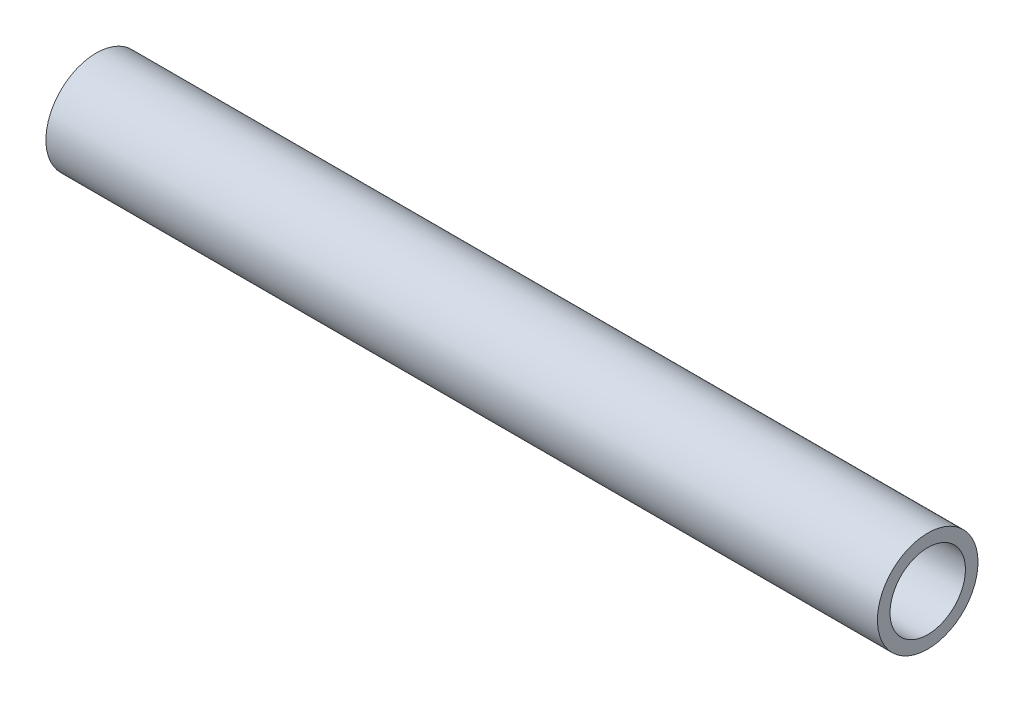
ISO-10303-21;
HEADER;
FILE_DESCRIPTION(('STEP AP214'),'2;1');
FILE_NAME('part.step','',(''),(''),'','','');
FILE_SCHEMA(('AUTOMOTIVE_DESIGN { 1 0 10303 214 1 1 1 1 }'));
ENDSEC;
DATA;
#1=APPLICATION_CONTEXT('core data for automotive mechanical design processes');
#2=APPLICATION_PROTOCOL_DEFINITION('international standard','automotive_design',2000,#1);
#3=PRODUCT_CONTEXT('',#1,'mechanical');
#4=PRODUCT('Part','Part','',(#3));
#5=PRODUCT_RELATED_PRODUCT_CATEGORY('part','',(#4));
#6=PRODUCT_DEFINITION_FORMATION('','',#4);
#7=PRODUCT_DEFINITION_CONTEXT('part definition',#1,'design');
#8=PRODUCT_DEFINITION('design','',#6,#7);
#9=PRODUCT_DEFINITION_SHAPE('','',#8);
#10=(LENGTH_UNIT() NAMED_UNIT(*) SI_UNIT(.MILLI.,.METRE.));
#11=(NAMED_UNIT(*) PLANE_ANGLE_UNIT() SI_UNIT($,.RADIAN.));
#12=(NAMED_UNIT(*) SI_UNIT($,.STERADIAN.) SOLID_ANGLE_UNIT());
#13=UNCERTAINTY_MEASURE_WITH_UNIT(LENGTH_MEASURE(1.E-05),#10,'distance_accuracy_value','');
#14=(GEOMETRIC_REPRESENTATION_CONTEXT(3) GLOBAL_UNCERTAINTY_ASSIGNED_CONTEXT((#13)) GLOBAL_UNIT_ASSIGNED_CONTEXT((#10,
#11,#12)) REPRESENTATION_CONTEXT('',''));
#15=CARTESIAN_POINT('',(0.,0.,0.));
#16=DIRECTION('',(0.,0.,1.));
#17=DIRECTION('',(1.,0.,0.));
#18=AXIS2_PLACEMENT_3D('',#15,#16,#17);
#19=CARTESIAN_POINT('',(105.,0.,0.));
#20=DIRECTION('',(1.,0.,0.));
#21=DIRECTION('',(0.,0.,-1.));
#22=AXIS2_PLACEMENT_3D('',#19,#20,#21);
#23=PLANE('',#22);
#24=CARTESIAN_POINT('',(105.,0.,0.));
#25=DIRECTION('',(1.,0.,0.));
#26=DIRECTION('',(0.,0.,-1.));
#27=AXIS2_PLACEMENT_3D('',#24,#25,#26);
#28=CIRCLE('',#27,12.7);
#29=CARTESIAN_POINT('',(105.,0.,-12.7));
#30=VERTEX_POINT('',#29);
#31=EDGE_CURVE('E10',#30,#30,#28,.T.);
#32=ORIENTED_EDGE('',*,*,#31,.T.);
#33=EDGE_LOOP('',(#32));
#34=FACE_BOUND('',#33,.T.);
#35=CARTESIAN_POINT('',(105.,0.,0.));
#36=DIRECTION('',(1.,0.,0.));
#37=DIRECTION('',(0.,0.,-1.));
#38=AXIS2_PLACEMENT_3D('',#35,#36,#37);
#39=CIRCLE('',#38,9.525);
#40=CARTESIAN_POINT('',(105.,0.,-9.525));
#41=VERTEX_POINT('',#40);
#42=EDGE_CURVE('E42',#41,#41,#39,.T.);
#43=ORIENTED_EDGE('',*,*,#42,.F.);
#44=EDGE_LOOP('',(#43));
#45=FACE_BOUND('',#44,.T.);
#46=ADVANCED_FACE('F31',(#34,#45),#23,.T.);
#47=CARTESIAN_POINT('',(-105.,0.,0.));
#48=DIRECTION('',(1.,0.,0.));
#49=DIRECTION('',(0.,0.,-1.));
#50=AXIS2_PLACEMENT_3D('',#47,#48,#49);
#51=PLANE('',#50);
#52=CARTESIAN_POINT('',(-105.,0.,0.));
#53=DIRECTION('',(1.,0.,0.));
#54=DIRECTION('',(0.,0.,-1.));
#55=AXIS2_PLACEMENT_3D('',#52,#53,#54);
#56=CIRCLE('',#55,12.7);
#57=CARTESIAN_POINT('',(-105.,0.,-12.7));
#58=VERTEX_POINT('',#57);
#59=EDGE_CURVE('E35',#58,#58,#56,.T.);
#60=ORIENTED_EDGE('',*,*,#59,.F.);
#61=EDGE_LOOP('',(#60));
#62=FACE_BOUND('',#61,.T.);
#63=CARTESIAN_POINT('',(-105.,0.,0.));
#64=DIRECTION('',(1.,0.,0.));
#65=DIRECTION('',(0.,0.,-1.));
#66=AXIS2_PLACEMENT_3D('',#63,#64,#65);
#67=CIRCLE('',#66,9.525);
#68=CARTESIAN_POINT('',(-105.,0.,-9.525));
#69=VERTEX_POINT('',#68);
#70=EDGE_CURVE('E44',#69,#69,#67,.T.);
#71=ORIENTED_EDGE('',*,*,#70,.T.);
#72=EDGE_LOOP('',(#71));
#73=FACE_BOUND('',#72,.T.);
#74=ADVANCED_FACE('F54',(#62,#73),#51,.F.);
#75=CARTESIAN_POINT('',(105.,0.,0.));
#76=DIRECTION('',(-1.,0.,0.));
#77=DIRECTION('',(0.,0.,1.));
#78=AXIS2_PLACEMENT_3D('',#75,#76,#77);
#79=CYLINDRICAL_SURFACE('',#78,12.7);
#80=ORIENTED_EDGE('',*,*,#31,.F.);
#81=EDGE_LOOP('',(#80));
#82=FACE_BOUND('',#81,.T.);
#83=ORIENTED_EDGE('',*,*,#59,.T.);
#84=EDGE_LOOP('',(#83));
#85=FACE_BOUND('',#84,.T.);
#86=ADVANCED_FACE('F33',(#82,#85),#79,.T.);
#87=CARTESIAN_POINT('',(105.,0.,0.));
#88=DIRECTION('',(-1.,0.,0.));
#89=DIRECTION('',(0.,0.,1.));
#90=AXIS2_PLACEMENT_3D('',#87,#88,#89);
#91=CYLINDRICAL_SURFACE('',#90,9.525);
#92=ORIENTED_EDGE('',*,*,#42,.T.);
#93=EDGE_LOOP('',(#92));
#94=FACE_BOUND('',#93,.T.);
#95=ORIENTED_EDGE('',*,*,#70,.F.);
#96=EDGE_LOOP('',(#95));
#97=FACE_BOUND('',#96,.T.);
#98=ADVANCED_FACE('F50',(#94,#97),#91,.F.);
#99=CLOSED_SHELL('',(#46,#74,#86,#98));
#100=MANIFOLD_SOLID_BREP('B2',#99);
#101=ADVANCED_BREP_SHAPE_REPRESENTATION('',(#18,#100),#14);
#102=SHAPE_DEFINITION_REPRESENTATION(#9,#101);
ENDSEC;
END-ISO-10303-21;
